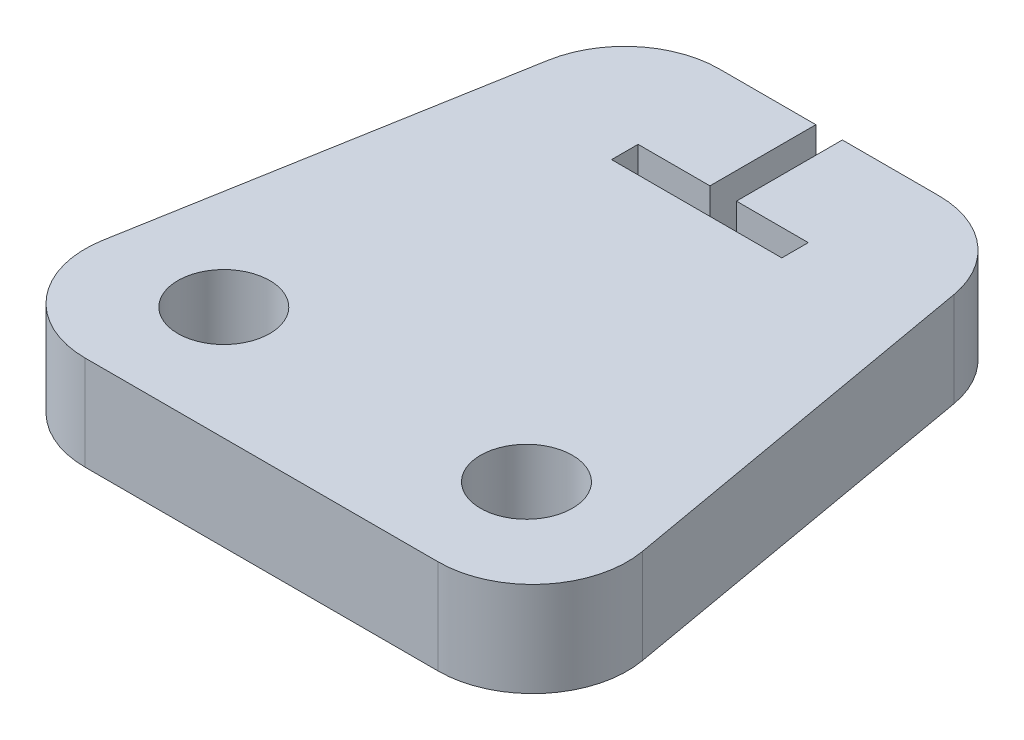
ISO-10303-21;
HEADER;
FILE_DESCRIPTION(('STEP AP214'),'2;1');
FILE_NAME('part.step','',(''),(''),'','','');
FILE_SCHEMA(('AUTOMOTIVE_DESIGN { 1 0 10303 214 1 1 1 1 }'));
ENDSEC;
DATA;
#1=APPLICATION_CONTEXT('core data for automotive mechanical design processes');
#2=APPLICATION_PROTOCOL_DEFINITION('international standard','automotive_design',2000,#1);
#3=PRODUCT_CONTEXT('',#1,'mechanical');
#4=PRODUCT('Part','Part','',(#3));
#5=PRODUCT_RELATED_PRODUCT_CATEGORY('part','',(#4));
#6=PRODUCT_DEFINITION_FORMATION('','',#4);
#7=PRODUCT_DEFINITION_CONTEXT('part definition',#1,'design');
#8=PRODUCT_DEFINITION('design','',#6,#7);
#9=PRODUCT_DEFINITION_SHAPE('','',#8);
#10=(LENGTH_UNIT() NAMED_UNIT(*) SI_UNIT(.MILLI.,.METRE.));
#11=(NAMED_UNIT(*) PLANE_ANGLE_UNIT() SI_UNIT($,.RADIAN.));
#12=(NAMED_UNIT(*) SI_UNIT($,.STERADIAN.) SOLID_ANGLE_UNIT());
#13=UNCERTAINTY_MEASURE_WITH_UNIT(LENGTH_MEASURE(1.E-05),#10,'distance_accuracy_value','');
#14=(GEOMETRIC_REPRESENTATION_CONTEXT(3) GLOBAL_UNCERTAINTY_ASSIGNED_CONTEXT((#13)) GLOBAL_UNIT_ASSIGNED_CONTEXT((#10,
#11,#12)) REPRESENTATION_CONTEXT('',''));
#15=CARTESIAN_POINT('',(0.,0.,0.));
#16=DIRECTION('',(0.,0.,1.));
#17=DIRECTION('',(1.,0.,0.));
#18=AXIS2_PLACEMENT_3D('',#15,#16,#17);
#19=CARTESIAN_POINT('',(7.3717173420243,6.35,-38.1));
#20=DIRECTION('',(0.,0.,1.));
#21=DIRECTION('',(1.,0.,0.));
#22=AXIS2_PLACEMENT_3D('',#19,#20,#21);
#23=PLANE('',#22);
#24=DIRECTION('',(-1.,0.,0.));
#25=VECTOR('',#24,1.);
#26=CARTESIAN_POINT('',(7.3717173420243,0.,-38.1));
#27=LINE('',#26,#25);
#28=CARTESIAN_POINT('',(7.3717173420243,0.,-38.1));
#29=VERTEX_POINT('',#28);
#30=CARTESIAN_POINT('',(0.889,0.,-38.1));
#31=VERTEX_POINT('',#30);
#32=EDGE_CURVE('E159',#29,#31,#27,.T.);
#33=ORIENTED_EDGE('',*,*,#32,.T.);
#34=DIRECTION('',(0.,1.,0.));
#35=VECTOR('',#34,1.);
#36=CARTESIAN_POINT('',(0.889,0.,-38.1));
#37=LINE('',#36,#35);
#38=CARTESIAN_POINT('',(0.889,6.35,-38.1));
#39=VERTEX_POINT('',#38);
#40=EDGE_CURVE('E214',#31,#39,#37,.T.);
#41=ORIENTED_EDGE('',*,*,#40,.T.);
#42=DIRECTION('',(-1.,0.,0.));
#43=VECTOR('',#42,1.);
#44=CARTESIAN_POINT('',(7.3717173420243,6.35,-38.1));
#45=LINE('',#44,#43);
#46=CARTESIAN_POINT('',(7.3717173420243,6.35,-38.1));
#47=VERTEX_POINT('',#46);
#48=EDGE_CURVE('E128',#47,#39,#45,.T.);
#49=ORIENTED_EDGE('',*,*,#48,.F.);
#50=DIRECTION('',(0.,-1.,0.));
#51=VECTOR('',#50,1.);
#52=CARTESIAN_POINT('',(7.3717173420243,6.35,-38.1));
#53=LINE('',#52,#51);
#54=EDGE_CURVE('E138',#47,#29,#53,.T.);
#55=ORIENTED_EDGE('',*,*,#54,.T.);
#56=EDGE_LOOP('',(#33,#41,#49,#55));
#57=FACE_BOUND('',#56,.T.);
#58=ADVANCED_FACE('F33',(#57),#23,.F.);
#59=CARTESIAN_POINT('',(-11.8504226520194,6.35,-6.35));
#60=DIRECTION('',(0.,-1.,0.));
#61=DIRECTION('',(0.,0.,-1.));
#62=AXIS2_PLACEMENT_3D('',#59,#60,#61);
#63=CYLINDRICAL_SURFACE('',#62,6.35);
#64=CARTESIAN_POINT('',(-11.8504226520194,0.,-6.35));
#65=DIRECTION('',(0.,1.,0.));
#66=DIRECTION('',(0.,0.,-1.));
#67=AXIS2_PLACEMENT_3D('',#64,#65,#66);
#68=CIRCLE('',#67,6.35);
#69=CARTESIAN_POINT('',(-18.1039518836469,0.,-7.45266592818503));
#70=VERTEX_POINT('',#69);
#71=CARTESIAN_POINT('',(-11.8504226520194,0.,0.));
#72=VERTEX_POINT('',#71);
#73=EDGE_CURVE('E147',#70,#72,#68,.T.);
#74=ORIENTED_EDGE('',*,*,#73,.T.);
#75=DIRECTION('',(0.,-1.,0.));
#76=VECTOR('',#75,1.);
#77=CARTESIAN_POINT('',(-11.8504226520194,6.35,0.));
#78=LINE('',#77,#76);
#79=CARTESIAN_POINT('',(-11.8504226520194,6.35,0.));
#80=VERTEX_POINT('',#79);
#81=EDGE_CURVE('E11',#80,#72,#78,.T.);
#82=ORIENTED_EDGE('',*,*,#81,.F.);
#83=CARTESIAN_POINT('',(-11.8504226520194,6.35,-6.35));
#84=DIRECTION('',(0.,1.,0.));
#85=DIRECTION('',(0.,0.,-1.));
#86=AXIS2_PLACEMENT_3D('',#83,#84,#85);
#87=CIRCLE('',#86,6.35);
#88=CARTESIAN_POINT('',(-18.1039518836469,6.35,-7.45266592818503));
#89=VERTEX_POINT('',#88);
#90=EDGE_CURVE('E165',#89,#80,#87,.T.);
#91=ORIENTED_EDGE('',*,*,#90,.F.);
#92=DIRECTION('',(0.,-1.,0.));
#93=VECTOR('',#92,1.);
#94=CARTESIAN_POINT('',(-18.1039518836469,6.35,-7.45266592818503));
#95=LINE('',#94,#93);
#96=EDGE_CURVE('E143',#89,#70,#95,.T.);
#97=ORIENTED_EDGE('',*,*,#96,.T.);
#98=EDGE_LOOP('',(#74,#82,#91,#97));
#99=FACE_BOUND('',#98,.T.);
#100=ADVANCED_FACE('F35',(#99),#63,.T.);
#101=CARTESIAN_POINT('',(-11.8504226520194,6.35,0.));
#102=DIRECTION('',(0.,0.,-1.));
#103=DIRECTION('',(-1.,0.,0.));
#104=AXIS2_PLACEMENT_3D('',#101,#102,#103);
#105=PLANE('',#104);
#106=DIRECTION('',(1.,0.,0.));
#107=VECTOR('',#106,1.);
#108=CARTESIAN_POINT('',(-11.8504226520194,0.,0.));
#109=LINE('',#108,#107);
#110=CARTESIAN_POINT('',(11.8504226520194,0.,0.));
#111=VERTEX_POINT('',#110);
#112=EDGE_CURVE('E150',#72,#111,#109,.T.);
#113=ORIENTED_EDGE('',*,*,#112,.T.);
#114=DIRECTION('',(0.,-1.,0.));
#115=VECTOR('',#114,1.);
#116=CARTESIAN_POINT('',(11.8504226520194,6.35,0.));
#117=LINE('',#116,#115);
#118=CARTESIAN_POINT('',(11.8504226520194,6.35,0.));
#119=VERTEX_POINT('',#118);
#120=EDGE_CURVE('E41',#119,#111,#117,.T.);
#121=ORIENTED_EDGE('',*,*,#120,.F.);
#122=DIRECTION('',(1.,0.,0.));
#123=VECTOR('',#122,1.);
#124=CARTESIAN_POINT('',(-11.8504226520194,6.35,0.));
#125=LINE('',#124,#123);
#126=EDGE_CURVE('E98',#80,#119,#125,.T.);
#127=ORIENTED_EDGE('',*,*,#126,.F.);
#128=ORIENTED_EDGE('',*,*,#81,.T.);
#129=EDGE_LOOP('',(#113,#121,#127,#128));
#130=FACE_BOUND('',#129,.T.);
#131=ADVANCED_FACE('F343',(#130),#105,.F.);
#132=CARTESIAN_POINT('',(11.8504226520194,6.35,-6.35));
#133=DIRECTION('',(0.,-1.,0.));
#134=DIRECTION('',(0.,0.,-1.));
#135=AXIS2_PLACEMENT_3D('',#132,#133,#134);
#136=CYLINDRICAL_SURFACE('',#135,6.35);
#137=CARTESIAN_POINT('',(11.8504226520194,0.,-6.35));
#138=DIRECTION('',(0.,1.,0.));
#139=DIRECTION('',(0.,0.,1.));
#140=AXIS2_PLACEMENT_3D('',#137,#138,#139);
#141=CIRCLE('',#140,6.35);
#142=CARTESIAN_POINT('',(18.1039518836469,0.,-7.45266592818503));
#143=VERTEX_POINT('',#142);
#144=EDGE_CURVE('E153',#111,#143,#141,.T.);
#145=ORIENTED_EDGE('',*,*,#144,.T.);
#146=DIRECTION('',(0.,-1.,0.));
#147=VECTOR('',#146,1.);
#148=CARTESIAN_POINT('',(18.1039518836469,6.35,-7.45266592818503));
#149=LINE('',#148,#147);
#150=CARTESIAN_POINT('',(18.1039518836469,6.35,-7.45266592818503));
#151=VERTEX_POINT('',#150);
#152=EDGE_CURVE('E173',#151,#143,#149,.T.);
#153=ORIENTED_EDGE('',*,*,#152,.F.);
#154=CARTESIAN_POINT('',(11.8504226520194,6.35,-6.35));
#155=DIRECTION('',(0.,1.,0.));
#156=DIRECTION('',(0.,0.,1.));
#157=AXIS2_PLACEMENT_3D('',#154,#155,#156);
#158=CIRCLE('',#157,6.35);
#159=EDGE_CURVE('E181',#119,#151,#158,.T.);
#160=ORIENTED_EDGE('',*,*,#159,.F.);
#161=ORIENTED_EDGE('',*,*,#120,.T.);
#162=EDGE_LOOP('',(#145,#153,#160,#161));
#163=FACE_BOUND('',#162,.T.);
#164=ADVANCED_FACE('F179',(#163),#136,.T.);
#165=CARTESIAN_POINT('',(18.1039518836469,6.35,-7.45266592818503));
#166=DIRECTION('',(-0.984807753012207,0.,0.173648177666934));
#167=DIRECTION('',(0.173648177666934,0.,0.984807753012208));
#168=AXIS2_PLACEMENT_3D('',#165,#166,#167);
#169=PLANE('',#168);
#170=DIRECTION('',(-0.173648177666934,0.,-0.984807753012207));
#171=VECTOR('',#170,1.);
#172=CARTESIAN_POINT('',(18.1039518836469,0.,-7.45266592818503));
#173=LINE('',#172,#171);
#174=CARTESIAN_POINT('',(13.6252465736518,0.,-32.852665928185));
#175=VERTEX_POINT('',#174);
#176=EDGE_CURVE('E155',#143,#175,#173,.T.);
#177=ORIENTED_EDGE('',*,*,#176,.T.);
#178=DIRECTION('',(0.,-1.,0.));
#179=VECTOR('',#178,1.);
#180=CARTESIAN_POINT('',(13.6252465736518,6.35,-32.852665928185));
#181=LINE('',#180,#179);
#182=CARTESIAN_POINT('',(13.6252465736518,6.35,-32.852665928185));
#183=VERTEX_POINT('',#182);
#184=EDGE_CURVE('E170',#183,#175,#181,.T.);
#185=ORIENTED_EDGE('',*,*,#184,.F.);
#186=DIRECTION('',(-0.173648177666934,0.,-0.984807753012207));
#187=VECTOR('',#186,1.);
#188=CARTESIAN_POINT('',(18.1039518836469,6.35,-7.45266592818503));
#189=LINE('',#188,#187);
#190=EDGE_CURVE('E199',#151,#183,#189,.T.);
#191=ORIENTED_EDGE('',*,*,#190,.F.);
#192=ORIENTED_EDGE('',*,*,#152,.T.);
#193=EDGE_LOOP('',(#177,#185,#191,#192));
#194=FACE_BOUND('',#193,.T.);
#195=ADVANCED_FACE('F192',(#194),#169,.F.);
#196=CARTESIAN_POINT('',(7.3717173420243,6.35,-31.75));
#197=DIRECTION('',(0.,-1.,0.));
#198=DIRECTION('',(0.,0.,-1.));
#199=AXIS2_PLACEMENT_3D('',#196,#197,#198);
#200=CYLINDRICAL_SURFACE('',#199,6.35);
#201=CARTESIAN_POINT('',(7.3717173420243,0.,-31.75));
#202=DIRECTION('',(0.,1.,0.));
#203=DIRECTION('',(0.,0.,1.));
#204=AXIS2_PLACEMENT_3D('',#201,#202,#203);
#205=CIRCLE('',#204,6.35);
#206=EDGE_CURVE('E157',#175,#29,#205,.T.);
#207=ORIENTED_EDGE('',*,*,#206,.T.);
#208=ORIENTED_EDGE('',*,*,#54,.F.);
#209=CARTESIAN_POINT('',(7.3717173420243,6.35,-31.75));
#210=DIRECTION('',(0.,1.,0.));
#211=DIRECTION('',(0.,0.,1.));
#212=AXIS2_PLACEMENT_3D('',#209,#210,#211);
#213=CIRCLE('',#212,6.35);
#214=EDGE_CURVE('E129',#183,#47,#213,.T.);
#215=ORIENTED_EDGE('',*,*,#214,.F.);
#216=ORIENTED_EDGE('',*,*,#184,.T.);
#217=EDGE_LOOP('',(#207,#208,#215,#216));
#218=FACE_BOUND('',#217,.T.);
#219=ADVANCED_FACE('F196',(#218),#200,.T.);
#220=CARTESIAN_POINT('',(-0.889,6.35,-38.1));
#221=VERTEX_POINT('',#220);
#222=CARTESIAN_POINT('',(-7.3717173420243,6.35,-38.1));
#223=VERTEX_POINT('',#222);
#224=EDGE_CURVE('E115',#221,#223,#45,.T.);
#225=ORIENTED_EDGE('',*,*,#224,.F.);
#226=DIRECTION('',(0.,1.,0.));
#227=VECTOR('',#226,1.);
#228=CARTESIAN_POINT('',(-0.889,0.,-38.1));
#229=LINE('',#228,#227);
#230=CARTESIAN_POINT('',(-0.889,0.,-38.1));
#231=VERTEX_POINT('',#230);
#232=EDGE_CURVE('E217',#231,#221,#229,.T.);
#233=ORIENTED_EDGE('',*,*,#232,.F.);
#234=CARTESIAN_POINT('',(-7.3717173420243,0.,-38.1));
#235=VERTEX_POINT('',#234);
#236=EDGE_CURVE('E135',#231,#235,#27,.T.);
#237=ORIENTED_EDGE('',*,*,#236,.T.);
#238=DIRECTION('',(0.,-1.,0.));
#239=VECTOR('',#238,1.);
#240=CARTESIAN_POINT('',(-7.3717173420243,6.35,-38.1));
#241=LINE('',#240,#239);
#242=EDGE_CURVE('E132',#223,#235,#241,.T.);
#243=ORIENTED_EDGE('',*,*,#242,.F.);
#244=EDGE_LOOP('',(#225,#233,#237,#243));
#245=FACE_BOUND('',#244,.T.);
#246=ADVANCED_FACE('F133',(#245),#23,.F.);
#247=CARTESIAN_POINT('',(-7.3717173420243,6.35,-31.75));
#248=DIRECTION('',(0.,-1.,0.));
#249=DIRECTION('',(0.,0.,-1.));
#250=AXIS2_PLACEMENT_3D('',#247,#248,#249);
#251=CYLINDRICAL_SURFACE('',#250,6.35);
#252=CARTESIAN_POINT('',(-7.3717173420243,0.,-31.75));
#253=DIRECTION('',(0.,1.,0.));
#254=DIRECTION('',(0.,0.,1.));
#255=AXIS2_PLACEMENT_3D('',#252,#253,#254);
#256=CIRCLE('',#255,6.35);
#257=CARTESIAN_POINT('',(-13.6252465736518,0.,-32.852665928185));
#258=VERTEX_POINT('',#257);
#259=EDGE_CURVE('E162',#235,#258,#256,.T.);
#260=ORIENTED_EDGE('',*,*,#259,.T.);
#261=DIRECTION('',(0.,-1.,0.));
#262=VECTOR('',#261,1.);
#263=CARTESIAN_POINT('',(-13.6252465736518,6.35,-32.852665928185));
#264=LINE('',#263,#262);
#265=CARTESIAN_POINT('',(-13.6252465736518,6.35,-32.852665928185));
#266=VERTEX_POINT('',#265);
#267=EDGE_CURVE('E139',#266,#258,#264,.T.);
#268=ORIENTED_EDGE('',*,*,#267,.F.);
#269=CARTESIAN_POINT('',(-7.3717173420243,6.35,-31.75));
#270=DIRECTION('',(0.,1.,0.));
#271=DIRECTION('',(0.,0.,1.));
#272=AXIS2_PLACEMENT_3D('',#269,#270,#271);
#273=CIRCLE('',#272,6.35);
#274=EDGE_CURVE('E120',#223,#266,#273,.T.);
#275=ORIENTED_EDGE('',*,*,#274,.F.);
#276=ORIENTED_EDGE('',*,*,#242,.T.);
#277=EDGE_LOOP('',(#260,#268,#275,#276));
#278=FACE_BOUND('',#277,.T.);
#279=ADVANCED_FACE('F141',(#278),#251,.T.);
#280=CARTESIAN_POINT('',(-13.6252465736518,6.35,-32.852665928185));
#281=DIRECTION('',(0.984807753012207,0.,0.173648177666934));
#282=DIRECTION('',(0.173648177666934,0.,-0.984807753012208));
#283=AXIS2_PLACEMENT_3D('',#280,#281,#282);
#284=PLANE('',#283);
#285=DIRECTION('',(-0.173648177666934,0.,0.984807753012207));
#286=VECTOR('',#285,1.);
#287=CARTESIAN_POINT('',(-13.6252465736518,0.,-32.852665928185));
#288=LINE('',#287,#286);
#289=EDGE_CURVE('E90',#258,#70,#288,.T.);
#290=ORIENTED_EDGE('',*,*,#289,.T.);
#291=ORIENTED_EDGE('',*,*,#96,.F.);
#292=DIRECTION('',(-0.173648177666934,0.,0.984807753012207));
#293=VECTOR('',#292,1.);
#294=CARTESIAN_POINT('',(-13.6252465736518,6.35,-32.852665928185));
#295=LINE('',#294,#293);
#296=EDGE_CURVE('E57',#266,#89,#295,.T.);
#297=ORIENTED_EDGE('',*,*,#296,.F.);
#298=ORIENTED_EDGE('',*,*,#267,.T.);
#299=EDGE_LOOP('',(#290,#291,#297,#298));
#300=FACE_BOUND('',#299,.T.);
#301=ADVANCED_FACE('F352',(#300),#284,.F.);
#302=CARTESIAN_POINT('',(-11.8504226520194,6.35,-6.35));
#303=DIRECTION('',(0.,-1.,0.));
#304=DIRECTION('',(0.,0.,-1.));
#305=AXIS2_PLACEMENT_3D('',#302,#303,#304);
#306=PLANE('',#305);
#307=CARTESIAN_POINT('',(10.16,6.35,-7.62000000000003));
#308=DIRECTION('',(0.,1.,0.));
#309=DIRECTION('',(0.,0.,-1.));
#310=AXIS2_PLACEMENT_3D('',#307,#308,#309);
#311=CIRCLE('',#310,3.0861);
#312=CARTESIAN_POINT('',(10.16,6.35,-10.7061));
#313=VERTEX_POINT('',#312);
#314=EDGE_CURVE('E211',#313,#313,#311,.T.);
#315=ORIENTED_EDGE('',*,*,#314,.F.);
#316=EDGE_LOOP('',(#315));
#317=FACE_BOUND('',#316,.T.);
#318=CARTESIAN_POINT('',(-10.16,6.35,-7.62));
#319=DIRECTION('',(0.,1.,0.));
#320=DIRECTION('',(0.,0.,1.));
#321=AXIS2_PLACEMENT_3D('',#318,#319,#320);
#322=CIRCLE('',#321,3.0861);
#323=CARTESIAN_POINT('',(-10.16,6.35,-4.5339));
#324=VERTEX_POINT('',#323);
#325=EDGE_CURVE('E205',#324,#324,#322,.T.);
#326=ORIENTED_EDGE('',*,*,#325,.F.);
#327=EDGE_LOOP('',(#326));
#328=FACE_BOUND('',#327,.T.);
#329=ORIENTED_EDGE('',*,*,#48,.T.);
#330=DIRECTION('',(0.,0.,-1.));
#331=VECTOR('',#330,1.);
#332=CARTESIAN_POINT('',(0.889000000000001,6.35,-30.988));
#333=LINE('',#332,#331);
#334=CARTESIAN_POINT('',(0.889000000000001,6.35,-30.988));
#335=VERTEX_POINT('',#334);
#336=EDGE_CURVE('E240',#335,#39,#333,.T.);
#337=ORIENTED_EDGE('',*,*,#336,.F.);
#338=DIRECTION('',(-1.,0.,0.));
#339=VECTOR('',#338,1.);
#340=CARTESIAN_POINT('',(5.71500000000001,6.35,-30.988));
#341=LINE('',#340,#339);
#342=CARTESIAN_POINT('',(5.71500000000001,6.35,-30.988));
#343=VERTEX_POINT('',#342);
#344=EDGE_CURVE('E244',#343,#335,#341,.T.);
#345=ORIENTED_EDGE('',*,*,#344,.F.);
#346=DIRECTION('',(0.,0.,-1.));
#347=VECTOR('',#346,1.);
#348=CARTESIAN_POINT('',(5.71500000000001,6.35,-29.21));
#349=LINE('',#348,#347);
#350=CARTESIAN_POINT('',(5.71500000000001,6.35,-29.21));
#351=VERTEX_POINT('',#350);
#352=EDGE_CURVE('E247',#351,#343,#349,.T.);
#353=ORIENTED_EDGE('',*,*,#352,.F.);
#354=DIRECTION('',(1.,0.,0.));
#355=VECTOR('',#354,1.);
#356=CARTESIAN_POINT('',(-5.715,6.35,-29.21));
#357=LINE('',#356,#355);
#358=CARTESIAN_POINT('',(-5.715,6.35,-29.21));
#359=VERTEX_POINT('',#358);
#360=EDGE_CURVE('E250',#359,#351,#357,.T.);
#361=ORIENTED_EDGE('',*,*,#360,.F.);
#362=DIRECTION('',(0.,0.,1.));
#363=VECTOR('',#362,1.);
#364=CARTESIAN_POINT('',(-5.715,6.35,-30.988));
#365=LINE('',#364,#363);
#366=CARTESIAN_POINT('',(-5.715,6.35,-30.988));
#367=VERTEX_POINT('',#366);
#368=EDGE_CURVE('E253',#367,#359,#365,.T.);
#369=ORIENTED_EDGE('',*,*,#368,.F.);
#370=DIRECTION('',(-1.,0.,0.));
#371=VECTOR('',#370,1.);
#372=CARTESIAN_POINT('',(-0.888999999999999,6.35,-30.988));
#373=LINE('',#372,#371);
#374=CARTESIAN_POINT('',(-0.888999999999999,6.35,-30.988));
#375=VERTEX_POINT('',#374);
#376=EDGE_CURVE('E256',#375,#367,#373,.T.);
#377=ORIENTED_EDGE('',*,*,#376,.F.);
#378=DIRECTION('',(0.,0.,1.));
#379=VECTOR('',#378,1.);
#380=CARTESIAN_POINT('',(-0.889,6.35,-38.1));
#381=LINE('',#380,#379);
#382=EDGE_CURVE('E125',#221,#375,#381,.T.);
#383=ORIENTED_EDGE('',*,*,#382,.F.);
#384=ORIENTED_EDGE('',*,*,#224,.T.);
#385=ORIENTED_EDGE('',*,*,#274,.T.);
#386=ORIENTED_EDGE('',*,*,#296,.T.);
#387=ORIENTED_EDGE('',*,*,#90,.T.);
#388=ORIENTED_EDGE('',*,*,#126,.T.);
#389=ORIENTED_EDGE('',*,*,#159,.T.);
#390=ORIENTED_EDGE('',*,*,#190,.T.);
#391=ORIENTED_EDGE('',*,*,#214,.T.);
#392=EDGE_LOOP('',(#329,#337,#345,#353,#361,#369,#377,#383,#384,#385,#386,#387,#388,#389,#390,#391));
#393=FACE_BOUND('',#392,.T.);
#394=ADVANCED_FACE('F118',(#317,#328,#393),#306,.F.);
#395=CARTESIAN_POINT('',(-11.8504226520194,0.,-6.35));
#396=DIRECTION('',(0.,-1.,0.));
#397=DIRECTION('',(0.,0.,-1.));
#398=AXIS2_PLACEMENT_3D('',#395,#396,#397);
#399=PLANE('',#398);
#400=DIRECTION('',(0.,0.,-1.));
#401=VECTOR('',#400,1.);
#402=CARTESIAN_POINT('',(0.889000000000001,0.,-30.988));
#403=LINE('',#402,#401);
#404=CARTESIAN_POINT('',(0.889000000000001,0.,-30.988));
#405=VERTEX_POINT('',#404);
#406=EDGE_CURVE('E221',#405,#31,#403,.T.);
#407=ORIENTED_EDGE('',*,*,#406,.T.);
#408=ORIENTED_EDGE('',*,*,#32,.F.);
#409=ORIENTED_EDGE('',*,*,#206,.F.);
#410=ORIENTED_EDGE('',*,*,#176,.F.);
#411=ORIENTED_EDGE('',*,*,#144,.F.);
#412=ORIENTED_EDGE('',*,*,#112,.F.);
#413=ORIENTED_EDGE('',*,*,#73,.F.);
#414=ORIENTED_EDGE('',*,*,#289,.F.);
#415=ORIENTED_EDGE('',*,*,#259,.F.);
#416=ORIENTED_EDGE('',*,*,#236,.F.);
#417=DIRECTION('',(0.,0.,1.));
#418=VECTOR('',#417,1.);
#419=CARTESIAN_POINT('',(-0.889,0.,-38.1));
#420=LINE('',#419,#418);
#421=CARTESIAN_POINT('',(-0.889,0.,-30.988));
#422=VERTEX_POINT('',#421);
#423=EDGE_CURVE('E243',#231,#422,#420,.T.);
#424=ORIENTED_EDGE('',*,*,#423,.T.);
#425=DIRECTION('',(-1.,0.,0.));
#426=VECTOR('',#425,1.);
#427=CARTESIAN_POINT('',(-0.888999999999999,0.,-30.988));
#428=LINE('',#427,#426);
#429=CARTESIAN_POINT('',(-5.715,0.,-30.988));
#430=VERTEX_POINT('',#429);
#431=EDGE_CURVE('E48',#422,#430,#428,.T.);
#432=ORIENTED_EDGE('',*,*,#431,.T.);
#433=DIRECTION('',(0.,0.,1.));
#434=VECTOR('',#433,1.);
#435=CARTESIAN_POINT('',(-5.715,0.,-30.988));
#436=LINE('',#435,#434);
#437=CARTESIAN_POINT('',(-5.715,0.,-29.21));
#438=VERTEX_POINT('',#437);
#439=EDGE_CURVE('E270',#430,#438,#436,.T.);
#440=ORIENTED_EDGE('',*,*,#439,.T.);
#441=DIRECTION('',(1.,0.,0.));
#442=VECTOR('',#441,1.);
#443=CARTESIAN_POINT('',(-5.715,0.,-29.21));
#444=LINE('',#443,#442);
#445=CARTESIAN_POINT('',(5.71500000000001,0.,-29.21));
#446=VERTEX_POINT('',#445);
#447=EDGE_CURVE('E267',#438,#446,#444,.T.);
#448=ORIENTED_EDGE('',*,*,#447,.T.);
#449=DIRECTION('',(0.,0.,-1.));
#450=VECTOR('',#449,1.);
#451=CARTESIAN_POINT('',(5.71500000000001,0.,-29.21));
#452=LINE('',#451,#450);
#453=CARTESIAN_POINT('',(5.71500000000001,0.,-30.988));
#454=VERTEX_POINT('',#453);
#455=EDGE_CURVE('E264',#446,#454,#452,.T.);
#456=ORIENTED_EDGE('',*,*,#455,.T.);
#457=DIRECTION('',(-1.,0.,0.));
#458=VECTOR('',#457,1.);
#459=CARTESIAN_POINT('',(5.71500000000001,0.,-30.988));
#460=LINE('',#459,#458);
#461=EDGE_CURVE('E261',#454,#405,#460,.T.);
#462=ORIENTED_EDGE('',*,*,#461,.T.);
#463=EDGE_LOOP('',(#407,#408,#409,#410,#411,#412,#413,#414,#415,#416,#424,#432,#440,#448,#456,#462));
#464=FACE_BOUND('',#463,.T.);
#465=CARTESIAN_POINT('',(10.16,0.,-7.62000000000003));
#466=DIRECTION('',(0.,1.,0.));
#467=DIRECTION('',(0.,0.,-1.));
#468=AXIS2_PLACEMENT_3D('',#465,#466,#467);
#469=CIRCLE('',#468,3.0861);
#470=CARTESIAN_POINT('',(10.16,0.,-10.7061));
#471=VERTEX_POINT('',#470);
#472=EDGE_CURVE('E208',#471,#471,#469,.T.);
#473=ORIENTED_EDGE('',*,*,#472,.T.);
#474=EDGE_LOOP('',(#473));
#475=FACE_BOUND('',#474,.T.);
#476=CARTESIAN_POINT('',(-10.16,0.,-7.62));
#477=DIRECTION('',(0.,1.,0.));
#478=DIRECTION('',(0.,0.,1.));
#479=AXIS2_PLACEMENT_3D('',#476,#477,#478);
#480=CIRCLE('',#479,3.0861);
#481=CARTESIAN_POINT('',(-10.16,0.,-4.5339));
#482=VERTEX_POINT('',#481);
#483=EDGE_CURVE('E151',#482,#482,#480,.T.);
#484=ORIENTED_EDGE('',*,*,#483,.T.);
#485=EDGE_LOOP('',(#484));
#486=FACE_BOUND('',#485,.T.);
#487=ADVANCED_FACE('F185',(#464,#475,#486),#399,.T.);
#488=CARTESIAN_POINT('',(-10.16,0.,-7.62));
#489=DIRECTION('',(0.,1.,0.));
#490=DIRECTION('',(0.,0.,1.));
#491=AXIS2_PLACEMENT_3D('',#488,#489,#490);
#492=CYLINDRICAL_SURFACE('',#491,3.0861);
#493=ORIENTED_EDGE('',*,*,#483,.F.);
#494=EDGE_LOOP('',(#493));
#495=FACE_BOUND('',#494,.T.);
#496=ORIENTED_EDGE('',*,*,#325,.T.);
#497=EDGE_LOOP('',(#496));
#498=FACE_BOUND('',#497,.T.);
#499=ADVANCED_FACE('F373',(#495,#498),#492,.F.);
#500=CARTESIAN_POINT('',(10.16,0.,-7.62000000000003));
#501=DIRECTION('',(0.,1.,0.));
#502=DIRECTION('',(0.,0.,1.));
#503=AXIS2_PLACEMENT_3D('',#500,#501,#502);
#504=CYLINDRICAL_SURFACE('',#503,3.0861);
#505=ORIENTED_EDGE('',*,*,#472,.F.);
#506=EDGE_LOOP('',(#505));
#507=FACE_BOUND('',#506,.T.);
#508=ORIENTED_EDGE('',*,*,#314,.T.);
#509=EDGE_LOOP('',(#508));
#510=FACE_BOUND('',#509,.T.);
#511=ADVANCED_FACE('F377',(#507,#510),#504,.F.);
#512=CARTESIAN_POINT('',(0.889000000000001,0.,-30.988));
#513=DIRECTION('',(1.,0.,0.));
#514=DIRECTION('',(0.,0.,-1.));
#515=AXIS2_PLACEMENT_3D('',#512,#513,#514);
#516=PLANE('',#515);
#517=ORIENTED_EDGE('',*,*,#336,.T.);
#518=ORIENTED_EDGE('',*,*,#40,.F.);
#519=ORIENTED_EDGE('',*,*,#406,.F.);
#520=DIRECTION('',(0.,1.,0.));
#521=VECTOR('',#520,1.);
#522=CARTESIAN_POINT('',(0.889000000000001,0.,-30.988));
#523=LINE('',#522,#521);
#524=EDGE_CURVE('E235',#405,#335,#523,.T.);
#525=ORIENTED_EDGE('',*,*,#524,.T.);
#526=EDGE_LOOP('',(#517,#518,#519,#525));
#527=FACE_BOUND('',#526,.T.);
#528=ADVANCED_FACE('F310',(#527),#516,.F.);
#529=CARTESIAN_POINT('',(5.71500000000001,0.,-30.988));
#530=DIRECTION('',(0.,0.,-1.));
#531=DIRECTION('',(-1.,0.,0.));
#532=AXIS2_PLACEMENT_3D('',#529,#530,#531);
#533=PLANE('',#532);
#534=ORIENTED_EDGE('',*,*,#344,.T.);
#535=ORIENTED_EDGE('',*,*,#524,.F.);
#536=ORIENTED_EDGE('',*,*,#461,.F.);
#537=DIRECTION('',(0.,1.,0.));
#538=VECTOR('',#537,1.);
#539=CARTESIAN_POINT('',(5.71500000000001,0.,-30.988));
#540=LINE('',#539,#538);
#541=EDGE_CURVE('E232',#454,#343,#540,.T.);
#542=ORIENTED_EDGE('',*,*,#541,.T.);
#543=EDGE_LOOP('',(#534,#535,#536,#542));
#544=FACE_BOUND('',#543,.T.);
#545=ADVANCED_FACE('F315',(#544),#533,.F.);
#546=CARTESIAN_POINT('',(5.71500000000001,0.,-29.21));
#547=DIRECTION('',(1.,0.,0.));
#548=DIRECTION('',(0.,0.,-1.));
#549=AXIS2_PLACEMENT_3D('',#546,#547,#548);
#550=PLANE('',#549);
#551=ORIENTED_EDGE('',*,*,#352,.T.);
#552=ORIENTED_EDGE('',*,*,#541,.F.);
#553=ORIENTED_EDGE('',*,*,#455,.F.);
#554=DIRECTION('',(0.,1.,0.));
#555=VECTOR('',#554,1.);
#556=CARTESIAN_POINT('',(5.71500000000001,0.,-29.21));
#557=LINE('',#556,#555);
#558=EDGE_CURVE('E229',#446,#351,#557,.T.);
#559=ORIENTED_EDGE('',*,*,#558,.T.);
#560=EDGE_LOOP('',(#551,#552,#553,#559));
#561=FACE_BOUND('',#560,.T.);
#562=ADVANCED_FACE('F321',(#561),#550,.F.);
#563=CARTESIAN_POINT('',(-5.715,0.,-29.21));
#564=DIRECTION('',(0.,0.,1.));
#565=DIRECTION('',(1.,0.,0.));
#566=AXIS2_PLACEMENT_3D('',#563,#564,#565);
#567=PLANE('',#566);
#568=ORIENTED_EDGE('',*,*,#360,.T.);
#569=ORIENTED_EDGE('',*,*,#558,.F.);
#570=ORIENTED_EDGE('',*,*,#447,.F.);
#571=DIRECTION('',(0.,1.,0.));
#572=VECTOR('',#571,1.);
#573=CARTESIAN_POINT('',(-5.715,0.,-29.21));
#574=LINE('',#573,#572);
#575=EDGE_CURVE('E226',#438,#359,#574,.T.);
#576=ORIENTED_EDGE('',*,*,#575,.T.);
#577=EDGE_LOOP('',(#568,#569,#570,#576));
#578=FACE_BOUND('',#577,.T.);
#579=ADVANCED_FACE('F325',(#578),#567,.F.);
#580=CARTESIAN_POINT('',(-5.715,0.,-30.988));
#581=DIRECTION('',(-1.,0.,0.));
#582=DIRECTION('',(0.,0.,1.));
#583=AXIS2_PLACEMENT_3D('',#580,#581,#582);
#584=PLANE('',#583);
#585=ORIENTED_EDGE('',*,*,#368,.T.);
#586=ORIENTED_EDGE('',*,*,#575,.F.);
#587=ORIENTED_EDGE('',*,*,#439,.F.);
#588=DIRECTION('',(0.,1.,0.));
#589=VECTOR('',#588,1.);
#590=CARTESIAN_POINT('',(-5.715,0.,-30.988));
#591=LINE('',#590,#589);
#592=EDGE_CURVE('E223',#430,#367,#591,.T.);
#593=ORIENTED_EDGE('',*,*,#592,.T.);
#594=EDGE_LOOP('',(#585,#586,#587,#593));
#595=FACE_BOUND('',#594,.T.);
#596=ADVANCED_FACE('F328',(#595),#584,.F.);
#597=CARTESIAN_POINT('',(-0.888999999999999,0.,-30.988));
#598=DIRECTION('',(0.,0.,-1.));
#599=DIRECTION('',(-1.,0.,0.));
#600=AXIS2_PLACEMENT_3D('',#597,#598,#599);
#601=PLANE('',#600);
#602=ORIENTED_EDGE('',*,*,#376,.T.);
#603=ORIENTED_EDGE('',*,*,#592,.F.);
#604=ORIENTED_EDGE('',*,*,#431,.F.);
#605=DIRECTION('',(0.,1.,0.));
#606=VECTOR('',#605,1.);
#607=CARTESIAN_POINT('',(-0.888999999999999,0.,-30.988));
#608=LINE('',#607,#606);
#609=EDGE_CURVE('E220',#422,#375,#608,.T.);
#610=ORIENTED_EDGE('',*,*,#609,.T.);
#611=EDGE_LOOP('',(#602,#603,#604,#610));
#612=FACE_BOUND('',#611,.T.);
#613=ADVANCED_FACE('F329',(#612),#601,.F.);
#614=CARTESIAN_POINT('',(-0.889,0.,-38.1));
#615=DIRECTION('',(-1.,0.,0.));
#616=DIRECTION('',(0.,0.,1.));
#617=AXIS2_PLACEMENT_3D('',#614,#615,#616);
#618=PLANE('',#617);
#619=ORIENTED_EDGE('',*,*,#382,.T.);
#620=ORIENTED_EDGE('',*,*,#609,.F.);
#621=ORIENTED_EDGE('',*,*,#423,.F.);
#622=ORIENTED_EDGE('',*,*,#232,.T.);
#623=EDGE_LOOP('',(#619,#620,#621,#622));
#624=FACE_BOUND('',#623,.T.);
#625=ADVANCED_FACE('F279',(#624),#618,.F.);
#626=CLOSED_SHELL('',(#58,#100,#131,#164,#195,#219,#246,#279,#301,#394,#487,#499,#511,#528,#545,
#562,#579,#596,#613,#625));
#627=MANIFOLD_SOLID_BREP('B2',#626);
#628=ADVANCED_BREP_SHAPE_REPRESENTATION('',(#18,#627),#14);
#629=SHAPE_DEFINITION_REPRESENTATION(#9,#628);
ENDSEC;
END-ISO-10303-21;
